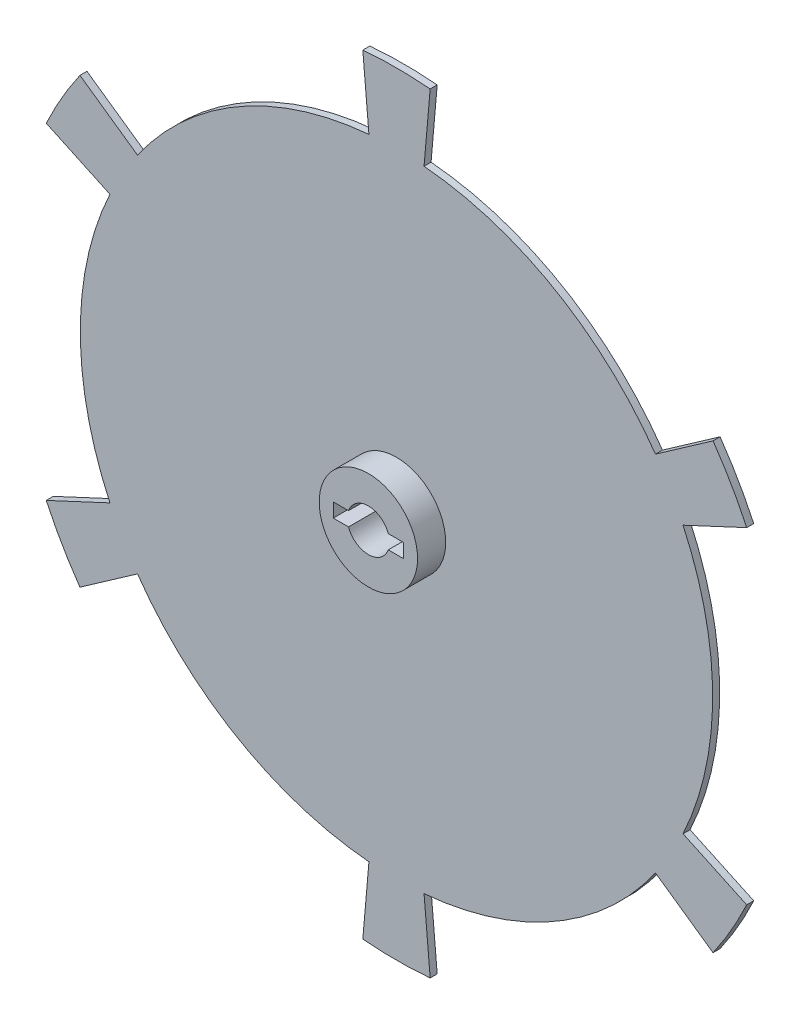
ISO-10303-21;
HEADER;
FILE_DESCRIPTION(('STEP AP214'),'2;1');
FILE_NAME('part.step','',(''),(''),'','','');
FILE_SCHEMA(('AUTOMOTIVE_DESIGN { 1 0 10303 214 1 1 1 1 }'));
ENDSEC;
DATA;
#1=APPLICATION_CONTEXT('core data for automotive mechanical design processes');
#2=APPLICATION_PROTOCOL_DEFINITION('international standard','automotive_design',2000,#1);
#3=PRODUCT_CONTEXT('',#1,'mechanical');
#4=PRODUCT('Part','Part','',(#3));
#5=PRODUCT_RELATED_PRODUCT_CATEGORY('part','',(#4));
#6=PRODUCT_DEFINITION_FORMATION('','',#4);
#7=PRODUCT_DEFINITION_CONTEXT('part definition',#1,'design');
#8=PRODUCT_DEFINITION('design','',#6,#7);
#9=PRODUCT_DEFINITION_SHAPE('','',#8);
#10=(LENGTH_UNIT() NAMED_UNIT(*) SI_UNIT(.MILLI.,.METRE.));
#11=(NAMED_UNIT(*) PLANE_ANGLE_UNIT() SI_UNIT($,.RADIAN.));
#12=(NAMED_UNIT(*) SI_UNIT($,.STERADIAN.) SOLID_ANGLE_UNIT());
#13=UNCERTAINTY_MEASURE_WITH_UNIT(LENGTH_MEASURE(1.E-05),#10,'distance_accuracy_value','');
#14=(GEOMETRIC_REPRESENTATION_CONTEXT(3) GLOBAL_UNCERTAINTY_ASSIGNED_CONTEXT((#13)) GLOBAL_UNIT_ASSIGNED_CONTEXT((#10,
#11,#12)) REPRESENTATION_CONTEXT('',''));
#15=CARTESIAN_POINT('',(0.,0.,0.));
#16=DIRECTION('',(0.,0.,1.));
#17=DIRECTION('',(1.,0.,0.));
#18=AXIS2_PLACEMENT_3D('',#15,#16,#17);
#19=CARTESIAN_POINT('',(0.,0.,10.));
#20=DIRECTION('',(0.,0.,-1.));
#21=DIRECTION('',(-1.,0.,0.));
#22=AXIS2_PLACEMENT_3D('',#19,#20,#21);
#23=CYLINDRICAL_SURFACE('',#22,450.);
#24=DIRECTION('',(0.,0.,1.));
#25=VECTOR('',#24,1.);
#26=CARTESIAN_POINT('',(-368.618419930031,-258.109396357993,-180.439839217952));
#27=LINE('',#26,#25);
#28=CARTESIAN_POINT('',(-368.618419930031,-258.109396357993,0.));
#29=VERTEX_POINT('',#28);
#30=CARTESIAN_POINT('',(-368.618419930031,-258.109396357993,10.));
#31=VERTEX_POINT('',#30);
#32=EDGE_CURVE('E263',#29,#31,#27,.T.);
#33=ORIENTED_EDGE('',*,*,#32,.F.);
#34=CARTESIAN_POINT('',(0.,0.,0.));
#35=DIRECTION('',(0.,0.,1.));
#36=DIRECTION('',(1.,0.,0.));
#37=AXIS2_PLACEMENT_3D('',#34,#35,#36);
#38=CIRCLE('',#37,450.);
#39=CARTESIAN_POINT('',(-39.2200842364212,-448.287614141288,0.));
#40=VERTEX_POINT('',#39);
#41=EDGE_CURVE('E504',#29,#40,#38,.T.);
#42=ORIENTED_EDGE('',*,*,#41,.T.);
#43=DIRECTION('',(0.,0.,1.));
#44=VECTOR('',#43,1.);
#45=CARTESIAN_POINT('',(-39.2200842364212,-448.287614141288,-180.439839217952));
#46=LINE('',#45,#44);
#47=CARTESIAN_POINT('',(-39.2200842364212,-448.287614141288,10.));
#48=VERTEX_POINT('',#47);
#49=EDGE_CURVE('E307',#40,#48,#46,.T.);
#50=ORIENTED_EDGE('',*,*,#49,.T.);
#51=CARTESIAN_POINT('',(0.,0.,10.));
#52=DIRECTION('',(0.,0.,1.));
#53=DIRECTION('',(1.,0.,0.));
#54=AXIS2_PLACEMENT_3D('',#51,#52,#53);
#55=CIRCLE('',#54,450.);
#56=EDGE_CURVE('E52',#31,#48,#55,.T.);
#57=ORIENTED_EDGE('',*,*,#56,.F.);
#58=EDGE_LOOP('',(#33,#42,#50,#57));
#59=FACE_BOUND('',#58,.T.);
#60=ADVANCED_FACE('F43',(#59),#23,.T.);
#61=DIRECTION('',(0.,0.,1.));
#62=VECTOR('',#61,1.);
#63=CARTESIAN_POINT('',(-407.83850416648,-190.178217783343,-180.439839217952));
#64=LINE('',#63,#62);
#65=CARTESIAN_POINT('',(-407.83850416648,-190.178217783343,0.));
#66=VERTEX_POINT('',#65);
#67=CARTESIAN_POINT('',(-407.83850416648,-190.178217783343,10.));
#68=VERTEX_POINT('',#67);
#69=EDGE_CURVE('E67',#66,#68,#64,.T.);
#70=ORIENTED_EDGE('',*,*,#69,.T.);
#71=CARTESIAN_POINT('',(-407.838504166492,190.178217783315,10.));
#72=VERTEX_POINT('',#71);
#73=EDGE_CURVE('E11',#72,#68,#55,.T.);
#74=ORIENTED_EDGE('',*,*,#73,.F.);
#75=DIRECTION('',(0.,0.,1.));
#76=VECTOR('',#75,1.);
#77=CARTESIAN_POINT('',(-407.838504166493,190.178217783315,-180.439839217952));
#78=LINE('',#77,#76);
#79=CARTESIAN_POINT('',(-407.838504166493,190.178217783315,0.));
#80=VERTEX_POINT('',#79);
#81=EDGE_CURVE('E421',#80,#72,#78,.T.);
#82=ORIENTED_EDGE('',*,*,#81,.F.);
#83=EDGE_CURVE('E47',#80,#66,#38,.T.);
#84=ORIENTED_EDGE('',*,*,#83,.T.);
#85=EDGE_LOOP('',(#70,#74,#82,#84));
#86=FACE_BOUND('',#85,.T.);
#87=ADVANCED_FACE('F567',(#86),#23,.T.);
#88=DIRECTION('',(0.,0.,1.));
#89=VECTOR('',#88,1.);
#90=CARTESIAN_POINT('',(39.220084236468,-448.287614141284,-180.439839217952));
#91=LINE('',#90,#89);
#92=CARTESIAN_POINT('',(39.220084236468,-448.287614141284,0.));
#93=VERTEX_POINT('',#92);
#94=CARTESIAN_POINT('',(39.220084236468,-448.287614141284,10.));
#95=VERTEX_POINT('',#94);
#96=EDGE_CURVE('E309',#93,#95,#91,.T.);
#97=ORIENTED_EDGE('',*,*,#96,.F.);
#98=CARTESIAN_POINT('',(368.618419930058,-258.109396357954,0.));
#99=VERTEX_POINT('',#98);
#100=EDGE_CURVE('E508',#93,#99,#38,.T.);
#101=ORIENTED_EDGE('',*,*,#100,.T.);
#102=DIRECTION('',(0.,0.,1.));
#103=VECTOR('',#102,1.);
#104=CARTESIAN_POINT('',(368.618419930058,-258.109396357954,-180.439839217952));
#105=LINE('',#104,#103);
#106=CARTESIAN_POINT('',(368.618419930058,-258.109396357954,10.));
#107=VERTEX_POINT('',#106);
#108=EDGE_CURVE('E334',#99,#107,#105,.T.);
#109=ORIENTED_EDGE('',*,*,#108,.T.);
#110=EDGE_CURVE('E587',#95,#107,#55,.T.);
#111=ORIENTED_EDGE('',*,*,#110,.F.);
#112=EDGE_LOOP('',(#97,#101,#109,#111));
#113=FACE_BOUND('',#112,.T.);
#114=ADVANCED_FACE('F572',(#113),#23,.T.);
#115=DIRECTION('',(0.,0.,1.));
#116=VECTOR('',#115,1.);
#117=CARTESIAN_POINT('',(407.8385041665,-190.1782177833,-180.439839217952));
#118=LINE('',#117,#116);
#119=CARTESIAN_POINT('',(407.8385041665,-190.1782177833,0.));
#120=VERTEX_POINT('',#119);
#121=CARTESIAN_POINT('',(407.8385041665,-190.1782177833,10.));
#122=VERTEX_POINT('',#121);
#123=EDGE_CURVE('E337',#120,#122,#118,.T.);
#124=ORIENTED_EDGE('',*,*,#123,.F.);
#125=CARTESIAN_POINT('',(407.838504166487,190.178217783328,0.));
#126=VERTEX_POINT('',#125);
#127=EDGE_CURVE('E503',#120,#126,#38,.T.);
#128=ORIENTED_EDGE('',*,*,#127,.T.);
#129=DIRECTION('',(0.,0.,1.));
#130=VECTOR('',#129,1.);
#131=CARTESIAN_POINT('',(407.838504166487,190.178217783327,-180.439839217952));
#132=LINE('',#131,#130);
#133=CARTESIAN_POINT('',(407.838504166487,190.178217783328,10.));
#134=VERTEX_POINT('',#133);
#135=EDGE_CURVE('E362',#126,#134,#132,.T.);
#136=ORIENTED_EDGE('',*,*,#135,.T.);
#137=EDGE_CURVE('E528',#122,#134,#55,.T.);
#138=ORIENTED_EDGE('',*,*,#137,.F.);
#139=EDGE_LOOP('',(#124,#128,#136,#138));
#140=FACE_BOUND('',#139,.T.);
#141=ADVANCED_FACE('F516',(#140),#23,.T.);
#142=DIRECTION('',(0.,0.,1.));
#143=VECTOR('',#142,1.);
#144=CARTESIAN_POINT('',(368.61841993004,258.10939635798,-180.439839217952));
#145=LINE('',#144,#143);
#146=CARTESIAN_POINT('',(368.61841993004,258.10939635798,0.));
#147=VERTEX_POINT('',#146);
#148=CARTESIAN_POINT('',(368.61841993004,258.10939635798,10.));
#149=VERTEX_POINT('',#148);
#150=EDGE_CURVE('E365',#147,#149,#145,.T.);
#151=ORIENTED_EDGE('',*,*,#150,.F.);
#152=CARTESIAN_POINT('',(39.2200842364377,448.287614141286,0.));
#153=VERTEX_POINT('',#152);
#154=EDGE_CURVE('E499',#147,#153,#38,.T.);
#155=ORIENTED_EDGE('',*,*,#154,.T.);
#156=DIRECTION('',(0.,0.,1.));
#157=VECTOR('',#156,1.);
#158=CARTESIAN_POINT('',(39.2200842364377,448.287614141286,-180.439839217952));
#159=LINE('',#158,#157);
#160=CARTESIAN_POINT('',(39.2200842364377,448.287614141286,10.));
#161=VERTEX_POINT('',#160);
#162=EDGE_CURVE('E390',#153,#161,#159,.T.);
#163=ORIENTED_EDGE('',*,*,#162,.T.);
#164=EDGE_CURVE('E507',#149,#161,#55,.T.);
#165=ORIENTED_EDGE('',*,*,#164,.F.);
#166=EDGE_LOOP('',(#151,#155,#163,#165));
#167=FACE_BOUND('',#166,.T.);
#168=ADVANCED_FACE('F539',(#167),#23,.T.);
#169=DIRECTION('',(0.,0.,1.));
#170=VECTOR('',#169,1.);
#171=CARTESIAN_POINT('',(-39.2200842364517,448.287614141285,-180.439839217952));
#172=LINE('',#171,#170);
#173=CARTESIAN_POINT('',(-39.2200842364517,448.287614141285,0.));
#174=VERTEX_POINT('',#173);
#175=CARTESIAN_POINT('',(-39.2200842364517,448.287614141285,10.));
#176=VERTEX_POINT('',#175);
#177=EDGE_CURVE('E393',#174,#176,#172,.T.);
#178=ORIENTED_EDGE('',*,*,#177,.F.);
#179=CARTESIAN_POINT('',(-368.618419930048,258.109396357968,0.));
#180=VERTEX_POINT('',#179);
#181=EDGE_CURVE('E497',#174,#180,#38,.T.);
#182=ORIENTED_EDGE('',*,*,#181,.T.);
#183=DIRECTION('',(0.,0.,1.));
#184=VECTOR('',#183,1.);
#185=CARTESIAN_POINT('',(-368.618419930048,258.109396357968,-180.439839217952));
#186=LINE('',#185,#184);
#187=CARTESIAN_POINT('',(-368.618419930048,258.109396357968,10.));
#188=VERTEX_POINT('',#187);
#189=EDGE_CURVE('E418',#180,#188,#186,.T.);
#190=ORIENTED_EDGE('',*,*,#189,.T.);
#191=EDGE_CURVE('E53',#176,#188,#55,.T.);
#192=ORIENTED_EDGE('',*,*,#191,.F.);
#193=EDGE_LOOP('',(#178,#182,#190,#192));
#194=FACE_BOUND('',#193,.T.);
#195=ADVANCED_FACE('F45',(#194),#23,.T.);
#196=CARTESIAN_POINT('',(0.,0.,10.));
#197=DIRECTION('',(0.,0.,1.));
#198=DIRECTION('',(1.,0.,0.));
#199=AXIS2_PLACEMENT_3D('',#196,#197,#198);
#200=PLANE('',#199);
#201=ORIENTED_EDGE('',*,*,#73,.T.);
#202=DIRECTION('',(0.906307787036621,0.422618261740761,0.));
#203=VECTOR('',#202,1.);
#204=CARTESIAN_POINT('',(0.,0.,10.));
#205=LINE('',#204,#203);
#206=CARTESIAN_POINT('',(-498.469282870142,-232.440043957419,10.));
#207=VERTEX_POINT('',#206);
#208=EDGE_CURVE('E264',#207,#68,#205,.T.);
#209=ORIENTED_EDGE('',*,*,#208,.F.);
#210=CARTESIAN_POINT('',(0.,0.,10.));
#211=DIRECTION('',(0.,0.,1.));
#212=DIRECTION('',(1.,0.,0.));
#213=AXIS2_PLACEMENT_3D('',#210,#211,#212);
#214=CIRCLE('',#213,550.);
#215=CARTESIAN_POINT('',(-450.533624358926,-315.467039993103,10.));
#216=VERTEX_POINT('',#215);
#217=EDGE_CURVE('E259',#216,#207,#214,.F.);
#218=ORIENTED_EDGE('',*,*,#217,.F.);
#219=DIRECTION('',(-0.819152044288957,-0.573576436351096,0.));
#220=VECTOR('',#219,1.);
#221=CARTESIAN_POINT('',(0.,0.,10.));
#222=LINE('',#221,#220);
#223=EDGE_CURVE('E267',#31,#216,#222,.T.);
#224=ORIENTED_EDGE('',*,*,#223,.F.);
#225=ORIENTED_EDGE('',*,*,#56,.T.);
#226=DIRECTION('',(0.0871557427476026,0.99619469809175,0.));
#227=VECTOR('',#226,1.);
#228=CARTESIAN_POINT('',(0.,0.,10.));
#229=LINE('',#228,#227);
#230=CARTESIAN_POINT('',(-47.9356585111814,-547.907083950463,10.));
#231=VERTEX_POINT('',#230);
#232=EDGE_CURVE('E301',#231,#48,#229,.T.);
#233=ORIENTED_EDGE('',*,*,#232,.F.);
#234=CARTESIAN_POINT('',(0.,0.,10.));
#235=DIRECTION('',(0.,0.,1.));
#236=DIRECTION('',(1.,0.,0.));
#237=AXIS2_PLACEMENT_3D('',#234,#235,#236);
#238=CIRCLE('',#237,550.);
#239=CARTESIAN_POINT('',(47.9356585112387,-547.907083950457,10.));
#240=VERTEX_POINT('',#239);
#241=EDGE_CURVE('E295',#240,#231,#238,.F.);
#242=ORIENTED_EDGE('',*,*,#241,.F.);
#243=DIRECTION('',(0.0871557427477068,-0.996194698091741,0.));
#244=VECTOR('',#243,1.);
#245=CARTESIAN_POINT('',(0.,0.,10.));
#246=LINE('',#245,#244);
#247=EDGE_CURVE('E298',#95,#240,#246,.T.);
#248=ORIENTED_EDGE('',*,*,#247,.F.);
#249=ORIENTED_EDGE('',*,*,#110,.T.);
#250=DIRECTION('',(-0.819152044289017,0.57357643635101,0.));
#251=VECTOR('',#250,1.);
#252=CARTESIAN_POINT('',(0.,0.,10.));
#253=LINE('',#252,#251);
#254=CARTESIAN_POINT('',(450.53362435896,-315.467039993055,10.));
#255=VERTEX_POINT('',#254);
#256=EDGE_CURVE('E328',#255,#107,#253,.T.);
#257=ORIENTED_EDGE('',*,*,#256,.F.);
#258=CARTESIAN_POINT('',(0.,0.,10.));
#259=DIRECTION('',(0.,0.,1.));
#260=DIRECTION('',(1.,0.,0.));
#261=AXIS2_PLACEMENT_3D('',#258,#259,#260);
#262=CIRCLE('',#261,550.);
#263=CARTESIAN_POINT('',(498.469282870166,-232.440043957366,10.));
#264=VERTEX_POINT('',#263);
#265=EDGE_CURVE('E294',#264,#255,#262,.F.);
#266=ORIENTED_EDGE('',*,*,#265,.F.);
#267=DIRECTION('',(0.906307787036666,-0.422618261740666,0.));
#268=VECTOR('',#267,1.);
#269=CARTESIAN_POINT('',(0.,0.,10.));
#270=LINE('',#269,#268);
#271=EDGE_CURVE('E325',#122,#264,#270,.T.);
#272=ORIENTED_EDGE('',*,*,#271,.F.);
#273=ORIENTED_EDGE('',*,*,#137,.T.);
#274=DIRECTION('',(-0.906307787036637,-0.422618261740728,0.));
#275=VECTOR('',#274,1.);
#276=CARTESIAN_POINT('',(0.,0.,10.));
#277=LINE('',#276,#275);
#278=CARTESIAN_POINT('',(498.46928287015,232.4400439574,10.));
#279=VERTEX_POINT('',#278);
#280=EDGE_CURVE('E356',#279,#134,#277,.T.);
#281=ORIENTED_EDGE('',*,*,#280,.F.);
#282=CARTESIAN_POINT('',(0.,0.,10.));
#283=DIRECTION('',(0.,0.,1.));
#284=DIRECTION('',(1.,0.,0.));
#285=AXIS2_PLACEMENT_3D('',#282,#283,#284);
#286=CIRCLE('',#285,550.);
#287=CARTESIAN_POINT('',(450.533624358938,315.467039993086,10.));
#288=VERTEX_POINT('',#287);
#289=EDGE_CURVE('E322',#288,#279,#286,.F.);
#290=ORIENTED_EDGE('',*,*,#289,.F.);
#291=DIRECTION('',(0.819152044288978,0.573576436351066,0.));
#292=VECTOR('',#291,1.);
#293=CARTESIAN_POINT('',(0.,0.,10.));
#294=LINE('',#293,#292);
#295=EDGE_CURVE('E353',#149,#288,#294,.T.);
#296=ORIENTED_EDGE('',*,*,#295,.F.);
#297=ORIENTED_EDGE('',*,*,#164,.T.);
#298=DIRECTION('',(-0.0871557427476393,-0.996194698091747,0.));
#299=VECTOR('',#298,1.);
#300=CARTESIAN_POINT('',(0.,0.,10.));
#301=LINE('',#300,#299);
#302=CARTESIAN_POINT('',(47.9356585112016,547.907083950461,10.));
#303=VERTEX_POINT('',#302);
#304=EDGE_CURVE('E384',#303,#161,#301,.T.);
#305=ORIENTED_EDGE('',*,*,#304,.F.);
#306=CARTESIAN_POINT('',(0.,0.,10.));
#307=DIRECTION('',(0.,0.,1.));
#308=DIRECTION('',(1.,0.,0.));
#309=AXIS2_PLACEMENT_3D('',#306,#307,#308);
#310=CIRCLE('',#309,550.);
#311=CARTESIAN_POINT('',(-47.9356585112187,547.90708395046,10.));
#312=VERTEX_POINT('',#311);
#313=EDGE_CURVE('E350',#312,#303,#310,.F.);
#314=ORIENTED_EDGE('',*,*,#313,.F.);
#315=DIRECTION('',(-0.0871557427476704,0.996194698091745,0.));
#316=VECTOR('',#315,1.);
#317=CARTESIAN_POINT('',(0.,0.,10.));
#318=LINE('',#317,#316);
#319=EDGE_CURVE('E381',#176,#312,#318,.T.);
#320=ORIENTED_EDGE('',*,*,#319,.F.);
#321=ORIENTED_EDGE('',*,*,#191,.T.);
#322=DIRECTION('',(0.819152044288996,-0.57357643635104,0.));
#323=VECTOR('',#322,1.);
#324=CARTESIAN_POINT('',(0.,0.,10.));
#325=LINE('',#324,#323);
#326=CARTESIAN_POINT('',(-450.533624358948,315.467039993072,10.));
#327=VERTEX_POINT('',#326);
#328=EDGE_CURVE('E412',#327,#188,#325,.T.);
#329=ORIENTED_EDGE('',*,*,#328,.F.);
#330=CARTESIAN_POINT('',(0.,0.,10.));
#331=DIRECTION('',(0.,0.,1.));
#332=DIRECTION('',(1.,0.,0.));
#333=AXIS2_PLACEMENT_3D('',#330,#331,#332);
#334=CIRCLE('',#333,550.);
#335=CARTESIAN_POINT('',(-498.469282870158,232.440043957385,10.));
#336=VERTEX_POINT('',#335);
#337=EDGE_CURVE('E378',#336,#327,#334,.F.);
#338=ORIENTED_EDGE('',*,*,#337,.F.);
#339=DIRECTION('',(-0.90630778703665,0.422618261740699,0.));
#340=VECTOR('',#339,1.);
#341=CARTESIAN_POINT('',(0.,0.,10.));
#342=LINE('',#341,#340);
#343=EDGE_CURVE('E409',#72,#336,#342,.T.);
#344=ORIENTED_EDGE('',*,*,#343,.F.);
#345=EDGE_LOOP('',(#201,#209,#218,#224,#225,#233,#242,#248,#249,#257,#266,#272,#273,#281,#290,
#296,#297,#305,#314,#320,#321,#329,#338,#344));
#346=FACE_BOUND('',#345,.T.);
#347=CARTESIAN_POINT('',(0.,0.,10.));
#348=DIRECTION('',(0.,0.,1.));
#349=DIRECTION('',(1.,0.,0.));
#350=AXIS2_PLACEMENT_3D('',#347,#348,#349);
#351=CIRCLE('',#350,70.);
#352=CARTESIAN_POINT('',(70.,0.,10.));
#353=VERTEX_POINT('',#352);
#354=EDGE_CURVE('E450',#353,#353,#351,.T.);
#355=ORIENTED_EDGE('',*,*,#354,.F.);
#356=EDGE_LOOP('',(#355));
#357=FACE_BOUND('',#356,.T.);
#358=ADVANCED_FACE('F272',(#346,#357),#200,.T.);
#359=CARTESIAN_POINT('',(0.,0.,0.));
#360=DIRECTION('',(0.,0.,1.));
#361=DIRECTION('',(1.,0.,0.));
#362=AXIS2_PLACEMENT_3D('',#359,#360,#361);
#363=PLANE('',#362);
#364=ORIENTED_EDGE('',*,*,#83,.F.);
#365=DIRECTION('',(0.90630778703665,-0.422618261740699,0.));
#366=VECTOR('',#365,1.);
#367=CARTESIAN_POINT('',(0.,0.,0.));
#368=LINE('',#367,#366);
#369=CARTESIAN_POINT('',(-498.469282870158,232.440043957385,0.));
#370=VERTEX_POINT('',#369);
#371=EDGE_CURVE('E403',#370,#80,#368,.T.);
#372=ORIENTED_EDGE('',*,*,#371,.F.);
#373=CARTESIAN_POINT('',(0.,0.,0.));
#374=DIRECTION('',(0.,0.,1.));
#375=DIRECTION('',(1.,0.,0.));
#376=AXIS2_PLACEMENT_3D('',#373,#374,#375);
#377=CIRCLE('',#376,550.);
#378=CARTESIAN_POINT('',(-450.533624358948,315.467039993072,0.));
#379=VERTEX_POINT('',#378);
#380=EDGE_CURVE('E402',#379,#370,#377,.T.);
#381=ORIENTED_EDGE('',*,*,#380,.F.);
#382=DIRECTION('',(-0.819152044288996,0.57357643635104,0.));
#383=VECTOR('',#382,1.);
#384=CARTESIAN_POINT('',(0.,0.,0.));
#385=LINE('',#384,#383);
#386=EDGE_CURVE('E399',#180,#379,#385,.T.);
#387=ORIENTED_EDGE('',*,*,#386,.F.);
#388=ORIENTED_EDGE('',*,*,#181,.F.);
#389=DIRECTION('',(0.0871557427476704,-0.996194698091745,0.));
#390=VECTOR('',#389,1.);
#391=CARTESIAN_POINT('',(0.,0.,0.));
#392=LINE('',#391,#390);
#393=CARTESIAN_POINT('',(-47.9356585112187,547.90708395046,0.));
#394=VERTEX_POINT('',#393);
#395=EDGE_CURVE('E375',#394,#174,#392,.T.);
#396=ORIENTED_EDGE('',*,*,#395,.F.);
#397=CARTESIAN_POINT('',(0.,0.,0.));
#398=DIRECTION('',(0.,0.,1.));
#399=DIRECTION('',(1.,0.,0.));
#400=AXIS2_PLACEMENT_3D('',#397,#398,#399);
#401=CIRCLE('',#400,550.);
#402=CARTESIAN_POINT('',(47.9356585112016,547.907083950461,0.));
#403=VERTEX_POINT('',#402);
#404=EDGE_CURVE('E374',#403,#394,#401,.T.);
#405=ORIENTED_EDGE('',*,*,#404,.F.);
#406=DIRECTION('',(0.0871557427476393,0.996194698091747,0.));
#407=VECTOR('',#406,1.);
#408=CARTESIAN_POINT('',(0.,0.,0.));
#409=LINE('',#408,#407);
#410=EDGE_CURVE('E371',#153,#403,#409,.T.);
#411=ORIENTED_EDGE('',*,*,#410,.F.);
#412=ORIENTED_EDGE('',*,*,#154,.F.);
#413=DIRECTION('',(-0.819152044288978,-0.573576436351066,0.));
#414=VECTOR('',#413,1.);
#415=CARTESIAN_POINT('',(0.,0.,0.));
#416=LINE('',#415,#414);
#417=CARTESIAN_POINT('',(450.533624358938,315.467039993086,0.));
#418=VERTEX_POINT('',#417);
#419=EDGE_CURVE('E347',#418,#147,#416,.T.);
#420=ORIENTED_EDGE('',*,*,#419,.F.);
#421=CARTESIAN_POINT('',(0.,0.,0.));
#422=DIRECTION('',(0.,0.,1.));
#423=DIRECTION('',(1.,0.,0.));
#424=AXIS2_PLACEMENT_3D('',#421,#422,#423);
#425=CIRCLE('',#424,550.);
#426=CARTESIAN_POINT('',(498.46928287015,232.4400439574,0.));
#427=VERTEX_POINT('',#426);
#428=EDGE_CURVE('E346',#427,#418,#425,.T.);
#429=ORIENTED_EDGE('',*,*,#428,.F.);
#430=DIRECTION('',(0.906307787036637,0.422618261740728,0.));
#431=VECTOR('',#430,1.);
#432=CARTESIAN_POINT('',(0.,0.,0.));
#433=LINE('',#432,#431);
#434=EDGE_CURVE('E343',#126,#427,#433,.T.);
#435=ORIENTED_EDGE('',*,*,#434,.F.);
#436=ORIENTED_EDGE('',*,*,#127,.F.);
#437=DIRECTION('',(-0.906307787036666,0.422618261740666,0.));
#438=VECTOR('',#437,1.);
#439=CARTESIAN_POINT('',(0.,0.,0.));
#440=LINE('',#439,#438);
#441=CARTESIAN_POINT('',(498.469282870166,-232.440043957366,0.));
#442=VERTEX_POINT('',#441);
#443=EDGE_CURVE('E319',#442,#120,#440,.T.);
#444=ORIENTED_EDGE('',*,*,#443,.F.);
#445=CARTESIAN_POINT('',(0.,0.,0.));
#446=DIRECTION('',(0.,0.,1.));
#447=DIRECTION('',(1.,0.,0.));
#448=AXIS2_PLACEMENT_3D('',#445,#446,#447);
#449=CIRCLE('',#448,550.);
#450=CARTESIAN_POINT('',(450.53362435896,-315.467039993055,0.));
#451=VERTEX_POINT('',#450);
#452=EDGE_CURVE('E318',#451,#442,#449,.T.);
#453=ORIENTED_EDGE('',*,*,#452,.F.);
#454=DIRECTION('',(0.819152044289017,-0.57357643635101,0.));
#455=VECTOR('',#454,1.);
#456=CARTESIAN_POINT('',(0.,0.,0.));
#457=LINE('',#456,#455);
#458=EDGE_CURVE('E315',#99,#451,#457,.T.);
#459=ORIENTED_EDGE('',*,*,#458,.F.);
#460=ORIENTED_EDGE('',*,*,#100,.F.);
#461=DIRECTION('',(-0.0871557427477068,0.996194698091741,0.));
#462=VECTOR('',#461,1.);
#463=CARTESIAN_POINT('',(0.,0.,0.));
#464=LINE('',#463,#462);
#465=CARTESIAN_POINT('',(47.9356585112387,-547.907083950457,0.));
#466=VERTEX_POINT('',#465);
#467=EDGE_CURVE('E291',#466,#93,#464,.T.);
#468=ORIENTED_EDGE('',*,*,#467,.F.);
#469=CARTESIAN_POINT('',(0.,0.,0.));
#470=DIRECTION('',(0.,0.,1.));
#471=DIRECTION('',(1.,0.,0.));
#472=AXIS2_PLACEMENT_3D('',#469,#470,#471);
#473=CIRCLE('',#472,550.);
#474=CARTESIAN_POINT('',(-47.9356585111814,-547.907083950463,0.));
#475=VERTEX_POINT('',#474);
#476=EDGE_CURVE('E290',#475,#466,#473,.T.);
#477=ORIENTED_EDGE('',*,*,#476,.F.);
#478=DIRECTION('',(-0.0871557427476026,-0.996194698091751,0.));
#479=VECTOR('',#478,1.);
#480=CARTESIAN_POINT('',(0.,0.,0.));
#481=LINE('',#480,#479);
#482=EDGE_CURVE('E287',#40,#475,#481,.T.);
#483=ORIENTED_EDGE('',*,*,#482,.F.);
#484=ORIENTED_EDGE('',*,*,#41,.F.);
#485=DIRECTION('',(0.819152044288957,0.573576436351096,0.));
#486=VECTOR('',#485,1.);
#487=CARTESIAN_POINT('',(0.,0.,0.));
#488=LINE('',#487,#486);
#489=CARTESIAN_POINT('',(-450.533624358926,-315.467039993103,0.));
#490=VERTEX_POINT('',#489);
#491=EDGE_CURVE('E282',#490,#29,#488,.T.);
#492=ORIENTED_EDGE('',*,*,#491,.F.);
#493=CARTESIAN_POINT('',(0.,0.,0.));
#494=DIRECTION('',(0.,0.,1.));
#495=DIRECTION('',(1.,0.,0.));
#496=AXIS2_PLACEMENT_3D('',#493,#494,#495);
#497=CIRCLE('',#496,550.);
#498=CARTESIAN_POINT('',(-498.469282870142,-232.440043957419,0.));
#499=VERTEX_POINT('',#498);
#500=EDGE_CURVE('E260',#499,#490,#497,.T.);
#501=ORIENTED_EDGE('',*,*,#500,.F.);
#502=DIRECTION('',(-0.906307787036621,-0.422618261740761,0.));
#503=VECTOR('',#502,1.);
#504=CARTESIAN_POINT('',(0.,0.,0.));
#505=LINE('',#504,#503);
#506=EDGE_CURVE('E286',#66,#499,#505,.T.);
#507=ORIENTED_EDGE('',*,*,#506,.F.);
#508=EDGE_LOOP('',(#364,#372,#381,#387,#388,#396,#405,#411,#412,#420,#429,#435,#436,#444,#453,
#459,#460,#468,#477,#483,#484,#492,#501,#507));
#509=FACE_BOUND('',#508,.T.);
#510=CARTESIAN_POINT('',(0.,0.,0.));
#511=DIRECTION('',(0.,0.,1.));
#512=DIRECTION('',(1.,0.,0.));
#513=AXIS2_PLACEMENT_3D('',#510,#511,#512);
#514=CIRCLE('',#513,30.);
#515=CARTESIAN_POINT('',(28.2842712474619,10.,0.));
#516=VERTEX_POINT('',#515);
#517=CARTESIAN_POINT('',(-28.2842712474619,10.,0.));
#518=VERTEX_POINT('',#517);
#519=EDGE_CURVE('E454',#516,#518,#514,.T.);
#520=ORIENTED_EDGE('',*,*,#519,.T.);
#521=DIRECTION('',(-1.,0.,0.));
#522=VECTOR('',#521,1.);
#523=CARTESIAN_POINT('',(-50.,10.,0.));
#524=LINE('',#523,#522);
#525=CARTESIAN_POINT('',(-50.,10.,0.));
#526=VERTEX_POINT('',#525);
#527=EDGE_CURVE('E459',#518,#526,#524,.T.);
#528=ORIENTED_EDGE('',*,*,#527,.T.);
#529=DIRECTION('',(0.,-1.,0.));
#530=VECTOR('',#529,1.);
#531=CARTESIAN_POINT('',(-50.,10.,0.));
#532=LINE('',#531,#530);
#533=CARTESIAN_POINT('',(-50.,-10.,0.));
#534=VERTEX_POINT('',#533);
#535=EDGE_CURVE('E462',#526,#534,#532,.T.);
#536=ORIENTED_EDGE('',*,*,#535,.T.);
#537=DIRECTION('',(1.,0.,0.));
#538=VECTOR('',#537,1.);
#539=CARTESIAN_POINT('',(-50.,-10.,0.));
#540=LINE('',#539,#538);
#541=CARTESIAN_POINT('',(-28.2842712474619,-10.,0.));
#542=VERTEX_POINT('',#541);
#543=EDGE_CURVE('E465',#534,#542,#540,.T.);
#544=ORIENTED_EDGE('',*,*,#543,.T.);
#545=CARTESIAN_POINT('',(0.,0.,0.));
#546=DIRECTION('',(0.,0.,1.));
#547=DIRECTION('',(1.,0.,0.));
#548=AXIS2_PLACEMENT_3D('',#545,#546,#547);
#549=CIRCLE('',#548,30.);
#550=CARTESIAN_POINT('',(28.2842712474619,-10.,0.));
#551=VERTEX_POINT('',#550);
#552=EDGE_CURVE('E468',#542,#551,#549,.T.);
#553=ORIENTED_EDGE('',*,*,#552,.T.);
#554=DIRECTION('',(1.,0.,0.));
#555=VECTOR('',#554,1.);
#556=CARTESIAN_POINT('',(28.2842712474619,-10.,0.));
#557=LINE('',#556,#555);
#558=CARTESIAN_POINT('',(50.,-10.,0.));
#559=VERTEX_POINT('',#558);
#560=EDGE_CURVE('E471',#551,#559,#557,.T.);
#561=ORIENTED_EDGE('',*,*,#560,.T.);
#562=DIRECTION('',(0.,1.,0.));
#563=VECTOR('',#562,1.);
#564=CARTESIAN_POINT('',(50.,10.,0.));
#565=LINE('',#564,#563);
#566=CARTESIAN_POINT('',(50.,10.,0.));
#567=VERTEX_POINT('',#566);
#568=EDGE_CURVE('E474',#559,#567,#565,.T.);
#569=ORIENTED_EDGE('',*,*,#568,.T.);
#570=DIRECTION('',(-1.,0.,0.));
#571=VECTOR('',#570,1.);
#572=CARTESIAN_POINT('',(28.2842712474619,10.,0.));
#573=LINE('',#572,#571);
#574=EDGE_CURVE('E477',#567,#516,#573,.T.);
#575=ORIENTED_EDGE('',*,*,#574,.T.);
#576=EDGE_LOOP('',(#520,#528,#536,#544,#553,#561,#569,#575));
#577=FACE_BOUND('',#576,.T.);
#578=ADVANCED_FACE('F519',(#509,#577),#363,.F.);
#579=CARTESIAN_POINT('',(0.,0.,10.));
#580=DIRECTION('',(0.,0.,-1.));
#581=DIRECTION('',(-1.,0.,0.));
#582=AXIS2_PLACEMENT_3D('',#579,#580,#581);
#583=CYLINDRICAL_SURFACE('',#582,30.);
#584=ORIENTED_EDGE('',*,*,#519,.F.);
#585=DIRECTION('',(0.,0.,-1.));
#586=VECTOR('',#585,1.);
#587=CARTESIAN_POINT('',(28.2842712474619,10.,10.));
#588=LINE('',#587,#586);
#589=CARTESIAN_POINT('',(28.2842712474619,10.,50.));
#590=VERTEX_POINT('',#589);
#591=EDGE_CURVE('E480',#590,#516,#588,.T.);
#592=ORIENTED_EDGE('',*,*,#591,.F.);
#593=CARTESIAN_POINT('',(0.,0.,50.));
#594=DIRECTION('',(0.,0.,1.));
#595=DIRECTION('',(1.,0.,0.));
#596=AXIS2_PLACEMENT_3D('',#593,#594,#595);
#597=CIRCLE('',#596,30.);
#598=CARTESIAN_POINT('',(-28.2842712474619,10.,50.));
#599=VERTEX_POINT('',#598);
#600=EDGE_CURVE('E447',#590,#599,#597,.T.);
#601=ORIENTED_EDGE('',*,*,#600,.T.);
#602=DIRECTION('',(0.,0.,-1.));
#603=VECTOR('',#602,1.);
#604=CARTESIAN_POINT('',(-28.2842712474619,10.,10.));
#605=LINE('',#604,#603);
#606=EDGE_CURVE('E495',#599,#518,#605,.T.);
#607=ORIENTED_EDGE('',*,*,#606,.T.);
#608=EDGE_LOOP('',(#584,#592,#601,#607));
#609=FACE_BOUND('',#608,.T.);
#610=ADVANCED_FACE('F672',(#609),#583,.F.);
#611=CARTESIAN_POINT('',(-50.,10.,10.));
#612=DIRECTION('',(0.,-1.,0.));
#613=DIRECTION('',(0.,0.,-1.));
#614=AXIS2_PLACEMENT_3D('',#611,#612,#613);
#615=PLANE('',#614);
#616=ORIENTED_EDGE('',*,*,#527,.F.);
#617=ORIENTED_EDGE('',*,*,#606,.F.);
#618=DIRECTION('',(-1.,0.,0.));
#619=VECTOR('',#618,1.);
#620=CARTESIAN_POINT('',(-50.,10.,50.));
#621=LINE('',#620,#619);
#622=CARTESIAN_POINT('',(-50.,10.,50.));
#623=VERTEX_POINT('',#622);
#624=EDGE_CURVE('E406',#599,#623,#621,.T.);
#625=ORIENTED_EDGE('',*,*,#624,.T.);
#626=DIRECTION('',(0.,0.,-1.));
#627=VECTOR('',#626,1.);
#628=CARTESIAN_POINT('',(-50.,10.,10.));
#629=LINE('',#628,#627);
#630=EDGE_CURVE('E493',#623,#526,#629,.T.);
#631=ORIENTED_EDGE('',*,*,#630,.T.);
#632=EDGE_LOOP('',(#616,#617,#625,#631));
#633=FACE_BOUND('',#632,.T.);
#634=ADVANCED_FACE('F668',(#633),#615,.T.);
#635=CARTESIAN_POINT('',(-50.,10.,10.));
#636=DIRECTION('',(1.,0.,0.));
#637=DIRECTION('',(0.,0.,-1.));
#638=AXIS2_PLACEMENT_3D('',#635,#636,#637);
#639=PLANE('',#638);
#640=ORIENTED_EDGE('',*,*,#535,.F.);
#641=ORIENTED_EDGE('',*,*,#630,.F.);
#642=DIRECTION('',(0.,-1.,0.));
#643=VECTOR('',#642,1.);
#644=CARTESIAN_POINT('',(-50.,10.,50.));
#645=LINE('',#644,#643);
#646=CARTESIAN_POINT('',(-50.,-10.,50.));
#647=VERTEX_POINT('',#646);
#648=EDGE_CURVE('E429',#623,#647,#645,.T.);
#649=ORIENTED_EDGE('',*,*,#648,.T.);
#650=DIRECTION('',(0.,0.,-1.));
#651=VECTOR('',#650,1.);
#652=CARTESIAN_POINT('',(-50.,-10.,10.));
#653=LINE('',#652,#651);
#654=EDGE_CURVE('E491',#647,#534,#653,.T.);
#655=ORIENTED_EDGE('',*,*,#654,.T.);
#656=EDGE_LOOP('',(#640,#641,#649,#655));
#657=FACE_BOUND('',#656,.T.);
#658=ADVANCED_FACE('F664',(#657),#639,.T.);
#659=CARTESIAN_POINT('',(-50.,-10.,10.));
#660=DIRECTION('',(0.,1.,0.));
#661=DIRECTION('',(0.,0.,1.));
#662=AXIS2_PLACEMENT_3D('',#659,#660,#661);
#663=PLANE('',#662);
#664=ORIENTED_EDGE('',*,*,#543,.F.);
#665=ORIENTED_EDGE('',*,*,#654,.F.);
#666=DIRECTION('',(1.,0.,0.));
#667=VECTOR('',#666,1.);
#668=CARTESIAN_POINT('',(-50.,-10.,50.));
#669=LINE('',#668,#667);
#670=CARTESIAN_POINT('',(-28.2842712474619,-10.,50.));
#671=VERTEX_POINT('',#670);
#672=EDGE_CURVE('E432',#647,#671,#669,.T.);
#673=ORIENTED_EDGE('',*,*,#672,.T.);
#674=DIRECTION('',(0.,0.,-1.));
#675=VECTOR('',#674,1.);
#676=CARTESIAN_POINT('',(-28.2842712474619,-10.,10.));
#677=LINE('',#676,#675);
#678=EDGE_CURVE('E489',#671,#542,#677,.T.);
#679=ORIENTED_EDGE('',*,*,#678,.T.);
#680=EDGE_LOOP('',(#664,#665,#673,#679));
#681=FACE_BOUND('',#680,.T.);
#682=ADVANCED_FACE('F660',(#681),#663,.T.);
#683=CARTESIAN_POINT('',(0.,0.,10.));
#684=DIRECTION('',(0.,0.,-1.));
#685=DIRECTION('',(-1.,0.,0.));
#686=AXIS2_PLACEMENT_3D('',#683,#684,#685);
#687=CYLINDRICAL_SURFACE('',#686,30.);
#688=ORIENTED_EDGE('',*,*,#552,.F.);
#689=ORIENTED_EDGE('',*,*,#678,.F.);
#690=CARTESIAN_POINT('',(0.,0.,50.));
#691=DIRECTION('',(0.,0.,1.));
#692=DIRECTION('',(1.,0.,0.));
#693=AXIS2_PLACEMENT_3D('',#690,#691,#692);
#694=CIRCLE('',#693,30.);
#695=CARTESIAN_POINT('',(28.2842712474619,-10.,50.));
#696=VERTEX_POINT('',#695);
#697=EDGE_CURVE('E435',#671,#696,#694,.T.);
#698=ORIENTED_EDGE('',*,*,#697,.T.);
#699=DIRECTION('',(0.,0.,-1.));
#700=VECTOR('',#699,1.);
#701=CARTESIAN_POINT('',(28.2842712474619,-10.,10.));
#702=LINE('',#701,#700);
#703=EDGE_CURVE('E487',#696,#551,#702,.T.);
#704=ORIENTED_EDGE('',*,*,#703,.T.);
#705=EDGE_LOOP('',(#688,#689,#698,#704));
#706=FACE_BOUND('',#705,.T.);
#707=ADVANCED_FACE('F656',(#706),#687,.F.);
#708=CARTESIAN_POINT('',(28.2842712474619,-10.,10.));
#709=DIRECTION('',(0.,1.,0.));
#710=DIRECTION('',(0.,0.,1.));
#711=AXIS2_PLACEMENT_3D('',#708,#709,#710);
#712=PLANE('',#711);
#713=ORIENTED_EDGE('',*,*,#560,.F.);
#714=ORIENTED_EDGE('',*,*,#703,.F.);
#715=DIRECTION('',(1.,0.,0.));
#716=VECTOR('',#715,1.);
#717=CARTESIAN_POINT('',(50.,-10.,50.));
#718=LINE('',#717,#716);
#719=CARTESIAN_POINT('',(50.,-10.,50.));
#720=VERTEX_POINT('',#719);
#721=EDGE_CURVE('E438',#696,#720,#718,.T.);
#722=ORIENTED_EDGE('',*,*,#721,.T.);
#723=DIRECTION('',(0.,0.,-1.));
#724=VECTOR('',#723,1.);
#725=CARTESIAN_POINT('',(50.,-10.,10.));
#726=LINE('',#725,#724);
#727=EDGE_CURVE('E485',#720,#559,#726,.T.);
#728=ORIENTED_EDGE('',*,*,#727,.T.);
#729=EDGE_LOOP('',(#713,#714,#722,#728));
#730=FACE_BOUND('',#729,.T.);
#731=ADVANCED_FACE('F652',(#730),#712,.T.);
#732=CARTESIAN_POINT('',(50.,10.,10.));
#733=DIRECTION('',(-1.,0.,0.));
#734=DIRECTION('',(0.,0.,1.));
#735=AXIS2_PLACEMENT_3D('',#732,#733,#734);
#736=PLANE('',#735);
#737=ORIENTED_EDGE('',*,*,#568,.F.);
#738=ORIENTED_EDGE('',*,*,#727,.F.);
#739=DIRECTION('',(0.,1.,0.));
#740=VECTOR('',#739,1.);
#741=CARTESIAN_POINT('',(50.,10.,50.));
#742=LINE('',#741,#740);
#743=CARTESIAN_POINT('',(50.,10.,50.));
#744=VERTEX_POINT('',#743);
#745=EDGE_CURVE('E441',#720,#744,#742,.T.);
#746=ORIENTED_EDGE('',*,*,#745,.T.);
#747=DIRECTION('',(0.,0.,-1.));
#748=VECTOR('',#747,1.);
#749=CARTESIAN_POINT('',(50.,10.,10.));
#750=LINE('',#749,#748);
#751=EDGE_CURVE('E483',#744,#567,#750,.T.);
#752=ORIENTED_EDGE('',*,*,#751,.T.);
#753=EDGE_LOOP('',(#737,#738,#746,#752));
#754=FACE_BOUND('',#753,.T.);
#755=ADVANCED_FACE('F648',(#754),#736,.T.);
#756=CARTESIAN_POINT('',(28.2842712474619,10.,10.));
#757=DIRECTION('',(0.,-1.,0.));
#758=DIRECTION('',(0.,0.,-1.));
#759=AXIS2_PLACEMENT_3D('',#756,#757,#758);
#760=PLANE('',#759);
#761=ORIENTED_EDGE('',*,*,#574,.F.);
#762=ORIENTED_EDGE('',*,*,#751,.F.);
#763=DIRECTION('',(-1.,0.,0.));
#764=VECTOR('',#763,1.);
#765=CARTESIAN_POINT('',(28.2842712474619,10.,50.));
#766=LINE('',#765,#764);
#767=EDGE_CURVE('E444',#744,#590,#766,.T.);
#768=ORIENTED_EDGE('',*,*,#767,.T.);
#769=ORIENTED_EDGE('',*,*,#591,.T.);
#770=EDGE_LOOP('',(#761,#762,#768,#769));
#771=FACE_BOUND('',#770,.T.);
#772=ADVANCED_FACE('F642',(#771),#760,.T.);
#773=CARTESIAN_POINT('',(0.,0.,50.));
#774=DIRECTION('',(0.,0.,1.));
#775=DIRECTION('',(1.,0.,0.));
#776=AXIS2_PLACEMENT_3D('',#773,#774,#775);
#777=PLANE('',#776);
#778=CARTESIAN_POINT('',(0.,0.,50.));
#779=DIRECTION('',(0.,0.,1.));
#780=DIRECTION('',(1.,0.,0.));
#781=AXIS2_PLACEMENT_3D('',#778,#779,#780);
#782=CIRCLE('',#781,70.);
#783=CARTESIAN_POINT('',(70.,0.,50.));
#784=VERTEX_POINT('',#783);
#785=EDGE_CURVE('E451',#784,#784,#782,.T.);
#786=ORIENTED_EDGE('',*,*,#785,.T.);
#787=EDGE_LOOP('',(#786));
#788=FACE_BOUND('',#787,.T.);
#789=ORIENTED_EDGE('',*,*,#648,.F.);
#790=ORIENTED_EDGE('',*,*,#624,.F.);
#791=ORIENTED_EDGE('',*,*,#600,.F.);
#792=ORIENTED_EDGE('',*,*,#767,.F.);
#793=ORIENTED_EDGE('',*,*,#745,.F.);
#794=ORIENTED_EDGE('',*,*,#721,.F.);
#795=ORIENTED_EDGE('',*,*,#697,.F.);
#796=ORIENTED_EDGE('',*,*,#672,.F.);
#797=EDGE_LOOP('',(#789,#790,#791,#792,#793,#794,#795,#796));
#798=FACE_BOUND('',#797,.T.);
#799=ADVANCED_FACE('F639',(#788,#798),#777,.T.);
#800=CARTESIAN_POINT('',(0.,0.,50.));
#801=DIRECTION('',(0.,0.,-1.));
#802=DIRECTION('',(-1.,0.,0.));
#803=AXIS2_PLACEMENT_3D('',#800,#801,#802);
#804=CYLINDRICAL_SURFACE('',#803,70.);
#805=ORIENTED_EDGE('',*,*,#785,.F.);
#806=EDGE_LOOP('',(#805));
#807=FACE_BOUND('',#806,.T.);
#808=ORIENTED_EDGE('',*,*,#354,.T.);
#809=EDGE_LOOP('',(#808));
#810=FACE_BOUND('',#809,.T.);
#811=ADVANCED_FACE('F636',(#807,#810),#804,.T.);
#812=CARTESIAN_POINT('',(0.,0.,-180.439839217952));
#813=DIRECTION('',(0.422618261740699,0.90630778703665,0.));
#814=DIRECTION('',(-0.90630778703665,0.422618261740699,0.));
#815=AXIS2_PLACEMENT_3D('',#812,#813,#814);
#816=PLANE('',#815);
#817=DIRECTION('',(0.,0.,1.));
#818=VECTOR('',#817,1.);
#819=CARTESIAN_POINT('',(-498.469282870158,232.440043957385,-180.439839217952));
#820=LINE('',#819,#818);
#821=EDGE_CURVE('E415',#370,#336,#820,.T.);
#822=ORIENTED_EDGE('',*,*,#821,.F.);
#823=ORIENTED_EDGE('',*,*,#371,.T.);
#824=ORIENTED_EDGE('',*,*,#81,.T.);
#825=ORIENTED_EDGE('',*,*,#343,.T.);
#826=EDGE_LOOP('',(#822,#823,#824,#825));
#827=FACE_BOUND('',#826,.T.);
#828=ADVANCED_FACE('F561',(#827),#816,.F.);
#829=CARTESIAN_POINT('',(0.,0.,-180.439839217952));
#830=DIRECTION('',(-0.57357643635104,-0.819152044288996,0.));
#831=DIRECTION('',(0.819152044288996,-0.57357643635104,0.));
#832=AXIS2_PLACEMENT_3D('',#829,#830,#831);
#833=PLANE('',#832);
#834=ORIENTED_EDGE('',*,*,#189,.F.);
#835=ORIENTED_EDGE('',*,*,#386,.T.);
#836=DIRECTION('',(0.,0.,1.));
#837=VECTOR('',#836,1.);
#838=CARTESIAN_POINT('',(-450.533624358948,315.467039993072,-180.439839217952));
#839=LINE('',#838,#837);
#840=EDGE_CURVE('E416',#379,#327,#839,.T.);
#841=ORIENTED_EDGE('',*,*,#840,.T.);
#842=ORIENTED_EDGE('',*,*,#328,.T.);
#843=EDGE_LOOP('',(#834,#835,#841,#842));
#844=FACE_BOUND('',#843,.T.);
#845=ADVANCED_FACE('F553',(#844),#833,.F.);
#846=CARTESIAN_POINT('',(0.,0.,-180.439839217952));
#847=DIRECTION('',(0.,0.,1.));
#848=DIRECTION('',(1.,0.,0.));
#849=AXIS2_PLACEMENT_3D('',#846,#847,#848);
#850=CYLINDRICAL_SURFACE('',#849,550.);
#851=ORIENTED_EDGE('',*,*,#840,.F.);
#852=ORIENTED_EDGE('',*,*,#380,.T.);
#853=ORIENTED_EDGE('',*,*,#821,.T.);
#854=ORIENTED_EDGE('',*,*,#337,.T.);
#855=EDGE_LOOP('',(#851,#852,#853,#854));
#856=FACE_BOUND('',#855,.T.);
#857=ADVANCED_FACE('F558',(#856),#850,.T.);
#858=CARTESIAN_POINT('',(0.,0.,-180.439839217952));
#859=DIRECTION('',(0.996194698091745,0.0871557427476704,0.));
#860=DIRECTION('',(-0.0871557427476704,0.996194698091745,0.));
#861=AXIS2_PLACEMENT_3D('',#858,#859,#860);
#862=PLANE('',#861);
#863=DIRECTION('',(0.,0.,1.));
#864=VECTOR('',#863,1.);
#865=CARTESIAN_POINT('',(-47.9356585112187,547.90708395046,-180.439839217952));
#866=LINE('',#865,#864);
#867=EDGE_CURVE('E387',#394,#312,#866,.T.);
#868=ORIENTED_EDGE('',*,*,#867,.F.);
#869=ORIENTED_EDGE('',*,*,#395,.T.);
#870=ORIENTED_EDGE('',*,*,#177,.T.);
#871=ORIENTED_EDGE('',*,*,#319,.T.);
#872=EDGE_LOOP('',(#868,#869,#870,#871));
#873=FACE_BOUND('',#872,.T.);
#874=ADVANCED_FACE('F550',(#873),#862,.F.);
#875=CARTESIAN_POINT('',(0.,0.,-180.439839217952));
#876=DIRECTION('',(-0.996194698091747,0.0871557427476393,0.));
#877=DIRECTION('',(-0.0871557427476393,-0.996194698091747,0.));
#878=AXIS2_PLACEMENT_3D('',#875,#876,#877);
#879=PLANE('',#878);
#880=ORIENTED_EDGE('',*,*,#162,.F.);
#881=ORIENTED_EDGE('',*,*,#410,.T.);
#882=DIRECTION('',(0.,0.,1.));
#883=VECTOR('',#882,1.);
#884=CARTESIAN_POINT('',(47.9356585112016,547.907083950461,-180.439839217952));
#885=LINE('',#884,#883);
#886=EDGE_CURVE('E388',#403,#303,#885,.T.);
#887=ORIENTED_EDGE('',*,*,#886,.T.);
#888=ORIENTED_EDGE('',*,*,#304,.T.);
#889=EDGE_LOOP('',(#880,#881,#887,#888));
#890=FACE_BOUND('',#889,.T.);
#891=ADVANCED_FACE('F542',(#890),#879,.F.);
#892=CARTESIAN_POINT('',(0.,0.,-180.439839217952));
#893=DIRECTION('',(0.,0.,1.));
#894=DIRECTION('',(1.,0.,0.));
#895=AXIS2_PLACEMENT_3D('',#892,#893,#894);
#896=CYLINDRICAL_SURFACE('',#895,550.);
#897=ORIENTED_EDGE('',*,*,#886,.F.);
#898=ORIENTED_EDGE('',*,*,#404,.T.);
#899=ORIENTED_EDGE('',*,*,#867,.T.);
#900=ORIENTED_EDGE('',*,*,#313,.T.);
#901=EDGE_LOOP('',(#897,#898,#899,#900));
#902=FACE_BOUND('',#901,.T.);
#903=ADVANCED_FACE('F545',(#902),#896,.T.);
#904=CARTESIAN_POINT('',(0.,0.,-180.439839217952));
#905=DIRECTION('',(0.573576436351066,-0.819152044288978,0.));
#906=DIRECTION('',(0.819152044288978,0.573576436351066,0.));
#907=AXIS2_PLACEMENT_3D('',#904,#905,#906);
#908=PLANE('',#907);
#909=DIRECTION('',(0.,0.,1.));
#910=VECTOR('',#909,1.);
#911=CARTESIAN_POINT('',(450.533624358938,315.467039993086,-180.439839217952));
#912=LINE('',#911,#910);
#913=EDGE_CURVE('E359',#418,#288,#912,.T.);
#914=ORIENTED_EDGE('',*,*,#913,.F.);
#915=ORIENTED_EDGE('',*,*,#419,.T.);
#916=ORIENTED_EDGE('',*,*,#150,.T.);
#917=ORIENTED_EDGE('',*,*,#295,.T.);
#918=EDGE_LOOP('',(#914,#915,#916,#917));
#919=FACE_BOUND('',#918,.T.);
#920=ADVANCED_FACE('F533',(#919),#908,.F.);
#921=CARTESIAN_POINT('',(0.,0.,-180.439839217952));
#922=DIRECTION('',(-0.422618261740728,0.906307787036637,0.));
#923=DIRECTION('',(-0.906307787036637,-0.422618261740728,0.));
#924=AXIS2_PLACEMENT_3D('',#921,#922,#923);
#925=PLANE('',#924);
#926=ORIENTED_EDGE('',*,*,#135,.F.);
#927=ORIENTED_EDGE('',*,*,#434,.T.);
#928=DIRECTION('',(0.,0.,1.));
#929=VECTOR('',#928,1.);
#930=CARTESIAN_POINT('',(498.46928287015,232.4400439574,-180.439839217952));
#931=LINE('',#930,#929);
#932=EDGE_CURVE('E360',#427,#279,#931,.T.);
#933=ORIENTED_EDGE('',*,*,#932,.T.);
#934=ORIENTED_EDGE('',*,*,#280,.T.);
#935=EDGE_LOOP('',(#926,#927,#933,#934));
#936=FACE_BOUND('',#935,.T.);
#937=ADVANCED_FACE('F523',(#936),#925,.F.);
#938=CARTESIAN_POINT('',(0.,0.,-180.439839217952));
#939=DIRECTION('',(0.,0.,1.));
#940=DIRECTION('',(1.,0.,0.));
#941=AXIS2_PLACEMENT_3D('',#938,#939,#940);
#942=CYLINDRICAL_SURFACE('',#941,550.);
#943=ORIENTED_EDGE('',*,*,#932,.F.);
#944=ORIENTED_EDGE('',*,*,#428,.T.);
#945=ORIENTED_EDGE('',*,*,#913,.T.);
#946=ORIENTED_EDGE('',*,*,#289,.T.);
#947=EDGE_LOOP('',(#943,#944,#945,#946));
#948=FACE_BOUND('',#947,.T.);
#949=ADVANCED_FACE('F530',(#948),#942,.T.);
#950=CARTESIAN_POINT('',(0.,0.,-180.439839217952));
#951=DIRECTION('',(-0.422618261740666,-0.906307787036666,0.));
#952=DIRECTION('',(0.906307787036666,-0.422618261740666,0.));
#953=AXIS2_PLACEMENT_3D('',#950,#951,#952);
#954=PLANE('',#953);
#955=DIRECTION('',(0.,0.,1.));
#956=VECTOR('',#955,1.);
#957=CARTESIAN_POINT('',(498.469282870166,-232.440043957366,-180.439839217952));
#958=LINE('',#957,#956);
#959=EDGE_CURVE('E331',#442,#264,#958,.T.);
#960=ORIENTED_EDGE('',*,*,#959,.F.);
#961=ORIENTED_EDGE('',*,*,#443,.T.);
#962=ORIENTED_EDGE('',*,*,#123,.T.);
#963=ORIENTED_EDGE('',*,*,#271,.T.);
#964=EDGE_LOOP('',(#960,#961,#962,#963));
#965=FACE_BOUND('',#964,.T.);
#966=ADVANCED_FACE('F609',(#965),#954,.F.);
#967=CARTESIAN_POINT('',(0.,0.,-180.439839217952));
#968=DIRECTION('',(0.57357643635101,0.819152044289017,0.));
#969=DIRECTION('',(-0.819152044289017,0.57357643635101,0.));
#970=AXIS2_PLACEMENT_3D('',#967,#968,#969);
#971=PLANE('',#970);
#972=ORIENTED_EDGE('',*,*,#108,.F.);
#973=ORIENTED_EDGE('',*,*,#458,.T.);
#974=DIRECTION('',(0.,0.,1.));
#975=VECTOR('',#974,1.);
#976=CARTESIAN_POINT('',(450.53362435896,-315.467039993055,-180.439839217952));
#977=LINE('',#976,#975);
#978=EDGE_CURVE('E332',#451,#255,#977,.T.);
#979=ORIENTED_EDGE('',*,*,#978,.T.);
#980=ORIENTED_EDGE('',*,*,#256,.T.);
#981=EDGE_LOOP('',(#972,#973,#979,#980));
#982=FACE_BOUND('',#981,.T.);
#983=ADVANCED_FACE('F603',(#982),#971,.F.);
#984=CARTESIAN_POINT('',(0.,0.,-180.439839217952));
#985=DIRECTION('',(0.,0.,1.));
#986=DIRECTION('',(1.,0.,0.));
#987=AXIS2_PLACEMENT_3D('',#984,#985,#986);
#988=CYLINDRICAL_SURFACE('',#987,550.);
#989=ORIENTED_EDGE('',*,*,#978,.F.);
#990=ORIENTED_EDGE('',*,*,#452,.T.);
#991=ORIENTED_EDGE('',*,*,#959,.T.);
#992=ORIENTED_EDGE('',*,*,#265,.T.);
#993=EDGE_LOOP('',(#989,#990,#991,#992));
#994=FACE_BOUND('',#993,.T.);
#995=ADVANCED_FACE('F606',(#994),#988,.T.);
#996=CARTESIAN_POINT('',(0.,0.,-180.439839217952));
#997=DIRECTION('',(-0.996194698091741,-0.0871557427477068,0.));
#998=DIRECTION('',(0.0871557427477068,-0.996194698091741,0.));
#999=AXIS2_PLACEMENT_3D('',#996,#997,#998);
#1000=PLANE('',#999);
#1001=DIRECTION('',(0.,0.,1.));
#1002=VECTOR('',#1001,1.);
#1003=CARTESIAN_POINT('',(47.9356585112387,-547.907083950457,-180.439839217952));
#1004=LINE('',#1003,#1002);
#1005=EDGE_CURVE('E304',#466,#240,#1004,.T.);
#1006=ORIENTED_EDGE('',*,*,#1005,.F.);
#1007=ORIENTED_EDGE('',*,*,#467,.T.);
#1008=ORIENTED_EDGE('',*,*,#96,.T.);
#1009=ORIENTED_EDGE('',*,*,#247,.T.);
#1010=EDGE_LOOP('',(#1006,#1007,#1008,#1009));
#1011=FACE_BOUND('',#1010,.T.);
#1012=ADVANCED_FACE('F591',(#1011),#1000,.F.);
#1013=CARTESIAN_POINT('',(0.,0.,-180.439839217952));
#1014=DIRECTION('',(0.99619469809175,-0.0871557427476026,0.));
#1015=DIRECTION('',(0.0871557427476026,0.996194698091751,0.));
#1016=AXIS2_PLACEMENT_3D('',#1013,#1014,#1015);
#1017=PLANE('',#1016);
#1018=ORIENTED_EDGE('',*,*,#49,.F.);
#1019=ORIENTED_EDGE('',*,*,#482,.T.);
#1020=DIRECTION('',(0.,0.,1.));
#1021=VECTOR('',#1020,1.);
#1022=CARTESIAN_POINT('',(-47.9356585111814,-547.907083950463,-180.439839217952));
#1023=LINE('',#1022,#1021);
#1024=EDGE_CURVE('E305',#475,#231,#1023,.T.);
#1025=ORIENTED_EDGE('',*,*,#1024,.T.);
#1026=ORIENTED_EDGE('',*,*,#232,.T.);
#1027=EDGE_LOOP('',(#1018,#1019,#1025,#1026));
#1028=FACE_BOUND('',#1027,.T.);
#1029=ADVANCED_FACE('F598',(#1028),#1017,.F.);
#1030=CARTESIAN_POINT('',(0.,0.,-180.439839217952));
#1031=DIRECTION('',(0.,0.,1.));
#1032=DIRECTION('',(1.,0.,0.));
#1033=AXIS2_PLACEMENT_3D('',#1030,#1031,#1032);
#1034=CYLINDRICAL_SURFACE('',#1033,550.);
#1035=ORIENTED_EDGE('',*,*,#1024,.F.);
#1036=ORIENTED_EDGE('',*,*,#476,.T.);
#1037=ORIENTED_EDGE('',*,*,#1005,.T.);
#1038=ORIENTED_EDGE('',*,*,#241,.T.);
#1039=EDGE_LOOP('',(#1035,#1036,#1037,#1038));
#1040=FACE_BOUND('',#1039,.T.);
#1041=ADVANCED_FACE('F594',(#1040),#1034,.T.);
#1042=CARTESIAN_POINT('',(0.,0.,-180.439839217952));
#1043=DIRECTION('',(-0.573576436351096,0.819152044288957,0.));
#1044=DIRECTION('',(-0.819152044288957,-0.573576436351096,0.));
#1045=AXIS2_PLACEMENT_3D('',#1042,#1043,#1044);
#1046=PLANE('',#1045);
#1047=DIRECTION('',(0.,0.,1.));
#1048=VECTOR('',#1047,1.);
#1049=CARTESIAN_POINT('',(-450.533624358926,-315.467039993103,-180.439839217952));
#1050=LINE('',#1049,#1048);
#1051=EDGE_CURVE('E254',#490,#216,#1050,.T.);
#1052=ORIENTED_EDGE('',*,*,#1051,.F.);
#1053=ORIENTED_EDGE('',*,*,#491,.T.);
#1054=ORIENTED_EDGE('',*,*,#32,.T.);
#1055=ORIENTED_EDGE('',*,*,#223,.T.);
#1056=EDGE_LOOP('',(#1052,#1053,#1054,#1055));
#1057=FACE_BOUND('',#1056,.T.);
#1058=ADVANCED_FACE('F268',(#1057),#1046,.F.);
#1059=CARTESIAN_POINT('',(0.,0.,-180.439839217952));
#1060=DIRECTION('',(0.422618261740761,-0.906307787036621,0.));
#1061=DIRECTION('',(0.906307787036621,0.422618261740761,0.));
#1062=AXIS2_PLACEMENT_3D('',#1059,#1060,#1061);
#1063=PLANE('',#1062);
#1064=ORIENTED_EDGE('',*,*,#69,.F.);
#1065=ORIENTED_EDGE('',*,*,#506,.T.);
#1066=DIRECTION('',(0.,0.,1.));
#1067=VECTOR('',#1066,1.);
#1068=CARTESIAN_POINT('',(-498.469282870142,-232.440043957419,-180.439839217952));
#1069=LINE('',#1068,#1067);
#1070=EDGE_CURVE('E280',#499,#207,#1069,.T.);
#1071=ORIENTED_EDGE('',*,*,#1070,.T.);
#1072=ORIENTED_EDGE('',*,*,#208,.T.);
#1073=EDGE_LOOP('',(#1064,#1065,#1071,#1072));
#1074=FACE_BOUND('',#1073,.T.);
#1075=ADVANCED_FACE('F563',(#1074),#1063,.F.);
#1076=CARTESIAN_POINT('',(0.,0.,-180.439839217952));
#1077=DIRECTION('',(0.,0.,1.));
#1078=DIRECTION('',(1.,0.,0.));
#1079=AXIS2_PLACEMENT_3D('',#1076,#1077,#1078);
#1080=CYLINDRICAL_SURFACE('',#1079,550.);
#1081=ORIENTED_EDGE('',*,*,#1070,.F.);
#1082=ORIENTED_EDGE('',*,*,#500,.T.);
#1083=ORIENTED_EDGE('',*,*,#1051,.T.);
#1084=ORIENTED_EDGE('',*,*,#217,.T.);
#1085=EDGE_LOOP('',(#1081,#1082,#1083,#1084));
#1086=FACE_BOUND('',#1085,.T.);
#1087=ADVANCED_FACE('F257',(#1086),#1080,.T.);
#1088=CLOSED_SHELL('',(#60,#87,#114,#141,#168,#195,#358,#578,#610,#634,#658,#682,#707,#731,#755,
#772,#799,#811,#828,#845,#857,#874,#891,#903,#920,#937,#949,#966,#983,#995,#1012,#1029,#1041,
#1058,#1075,#1087));
#1089=MANIFOLD_SOLID_BREP('B2',#1088);
#1090=ADVANCED_BREP_SHAPE_REPRESENTATION('',(#18,#1089),#14);
#1091=SHAPE_DEFINITION_REPRESENTATION(#9,#1090);
ENDSEC;
END-ISO-10303-21;
